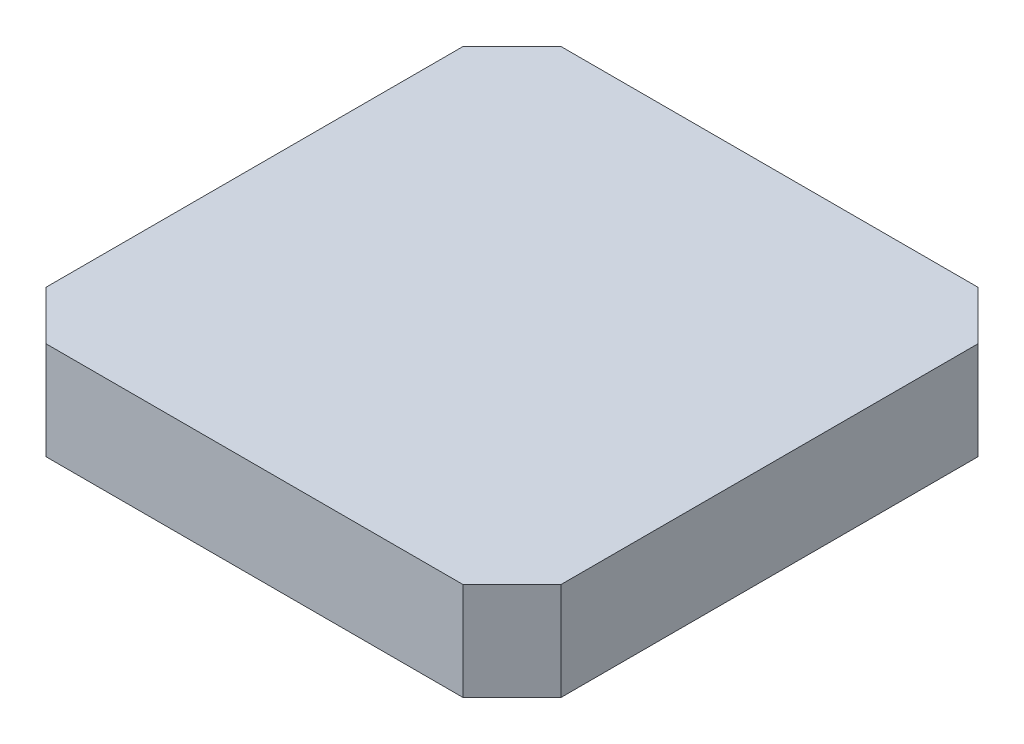
ISO-10303-21;
HEADER;
FILE_DESCRIPTION(('STEP AP214'),'2;1');
FILE_NAME('part.step','',(''),(''),'','','');
FILE_SCHEMA(('AUTOMOTIVE_DESIGN { 1 0 10303 214 1 1 1 1 }'));
ENDSEC;
DATA;
#1=APPLICATION_CONTEXT('core data for automotive mechanical design processes');
#2=APPLICATION_PROTOCOL_DEFINITION('international standard','automotive_design',2000,#1);
#3=PRODUCT_CONTEXT('',#1,'mechanical');
#4=PRODUCT('Part','Part','',(#3));
#5=PRODUCT_RELATED_PRODUCT_CATEGORY('part','',(#4));
#6=PRODUCT_DEFINITION_FORMATION('','',#4);
#7=PRODUCT_DEFINITION_CONTEXT('part definition',#1,'design');
#8=PRODUCT_DEFINITION('design','',#6,#7);
#9=PRODUCT_DEFINITION_SHAPE('','',#8);
#10=(LENGTH_UNIT() NAMED_UNIT(*) SI_UNIT(.MILLI.,.METRE.));
#11=(NAMED_UNIT(*) PLANE_ANGLE_UNIT() SI_UNIT($,.RADIAN.));
#12=(NAMED_UNIT(*) SI_UNIT($,.STERADIAN.) SOLID_ANGLE_UNIT());
#13=UNCERTAINTY_MEASURE_WITH_UNIT(LENGTH_MEASURE(1.E-05),#10,'distance_accuracy_value','');
#14=(GEOMETRIC_REPRESENTATION_CONTEXT(3) GLOBAL_UNCERTAINTY_ASSIGNED_CONTEXT((#13)) GLOBAL_UNIT_ASSIGNED_CONTEXT((#10,
#11,#12)) REPRESENTATION_CONTEXT('',''));
#15=CARTESIAN_POINT('',(0.,0.,0.));
#16=DIRECTION('',(0.,0.,1.));
#17=DIRECTION('',(1.,0.,0.));
#18=AXIS2_PLACEMENT_3D('',#15,#16,#17);
#19=CARTESIAN_POINT('',(21.05,8.,21.05));
#20=DIRECTION('',(-1.,0.,0.));
#21=DIRECTION('',(0.,0.,1.));
#22=AXIS2_PLACEMENT_3D('',#19,#20,#21);
#23=PLANE('',#22);
#24=DIRECTION('',(0.,0.,-1.));
#25=VECTOR('',#24,1.);
#26=CARTESIAN_POINT('',(21.05,0.,21.05));
#27=LINE('',#26,#25);
#28=CARTESIAN_POINT('',(21.05,0.,17.05));
#29=VERTEX_POINT('',#28);
#30=CARTESIAN_POINT('',(21.05,0.,-17.05));
#31=VERTEX_POINT('',#30);
#32=EDGE_CURVE('E127',#29,#31,#27,.T.);
#33=ORIENTED_EDGE('',*,*,#32,.T.);
#34=DIRECTION('',(0.,1.,0.));
#35=VECTOR('',#34,1.);
#36=CARTESIAN_POINT('',(21.05,8.,-17.05));
#37=LINE('',#36,#35);
#38=CARTESIAN_POINT('',(21.05,8.,-17.05));
#39=VERTEX_POINT('',#38);
#40=EDGE_CURVE('E104',#31,#39,#37,.T.);
#41=ORIENTED_EDGE('',*,*,#40,.T.);
#42=DIRECTION('',(0.,0.,-1.));
#43=VECTOR('',#42,1.);
#44=CARTESIAN_POINT('',(21.05,8.,21.05));
#45=LINE('',#44,#43);
#46=CARTESIAN_POINT('',(21.05,8.,17.05));
#47=VERTEX_POINT('',#46);
#48=EDGE_CURVE('E136',#47,#39,#45,.T.);
#49=ORIENTED_EDGE('',*,*,#48,.F.);
#50=DIRECTION('',(0.,-1.,0.));
#51=VECTOR('',#50,1.);
#52=CARTESIAN_POINT('',(21.05,8.,17.05));
#53=LINE('',#52,#51);
#54=EDGE_CURVE('E109',#47,#29,#53,.T.);
#55=ORIENTED_EDGE('',*,*,#54,.T.);
#56=EDGE_LOOP('',(#33,#41,#49,#55));
#57=FACE_BOUND('',#56,.T.);
#58=ADVANCED_FACE('F32',(#57),#23,.F.);
#59=CARTESIAN_POINT('',(-21.05,8.,-21.05));
#60=DIRECTION('',(0.,0.,1.));
#61=DIRECTION('',(1.,0.,0.));
#62=AXIS2_PLACEMENT_3D('',#59,#60,#61);
#63=PLANE('',#62);
#64=DIRECTION('',(-1.,0.,0.));
#65=VECTOR('',#64,1.);
#66=CARTESIAN_POINT('',(-21.05,8.,-21.05));
#67=LINE('',#66,#65);
#68=CARTESIAN_POINT('',(17.05,8.,-21.05));
#69=VERTEX_POINT('',#68);
#70=CARTESIAN_POINT('',(-17.05,8.,-21.05));
#71=VERTEX_POINT('',#70);
#72=EDGE_CURVE('E119',#69,#71,#67,.T.);
#73=ORIENTED_EDGE('',*,*,#72,.F.);
#74=DIRECTION('',(0.,-1.,0.));
#75=VECTOR('',#74,1.);
#76=CARTESIAN_POINT('',(17.05,8.,-21.05));
#77=LINE('',#76,#75);
#78=CARTESIAN_POINT('',(17.05,0.,-21.05));
#79=VERTEX_POINT('',#78);
#80=EDGE_CURVE('E103',#69,#79,#77,.T.);
#81=ORIENTED_EDGE('',*,*,#80,.T.);
#82=DIRECTION('',(-1.,0.,0.));
#83=VECTOR('',#82,1.);
#84=CARTESIAN_POINT('',(-21.05,0.,-21.05));
#85=LINE('',#84,#83);
#86=CARTESIAN_POINT('',(-17.05,0.,-21.05));
#87=VERTEX_POINT('',#86);
#88=EDGE_CURVE('E116',#79,#87,#85,.T.);
#89=ORIENTED_EDGE('',*,*,#88,.T.);
#90=DIRECTION('',(0.,1.,0.));
#91=VECTOR('',#90,1.);
#92=CARTESIAN_POINT('',(-17.05,8.,-21.05));
#93=LINE('',#92,#91);
#94=EDGE_CURVE('E121',#87,#71,#93,.T.);
#95=ORIENTED_EDGE('',*,*,#94,.T.);
#96=EDGE_LOOP('',(#73,#81,#89,#95));
#97=FACE_BOUND('',#96,.T.);
#98=ADVANCED_FACE('F115',(#97),#63,.F.);
#99=CARTESIAN_POINT('',(-21.05,8.,21.05));
#100=DIRECTION('',(1.,0.,0.));
#101=DIRECTION('',(0.,0.,-1.));
#102=AXIS2_PLACEMENT_3D('',#99,#100,#101);
#103=PLANE('',#102);
#104=DIRECTION('',(0.,0.,1.));
#105=VECTOR('',#104,1.);
#106=CARTESIAN_POINT('',(-21.05,8.,21.05));
#107=LINE('',#106,#105);
#108=CARTESIAN_POINT('',(-21.05,8.,-17.05));
#109=VERTEX_POINT('',#108);
#110=CARTESIAN_POINT('',(-21.05,8.,17.05));
#111=VERTEX_POINT('',#110);
#112=EDGE_CURVE('E159',#109,#111,#107,.T.);
#113=ORIENTED_EDGE('',*,*,#112,.F.);
#114=DIRECTION('',(0.,-1.,0.));
#115=VECTOR('',#114,1.);
#116=CARTESIAN_POINT('',(-21.05,8.,-17.05));
#117=LINE('',#116,#115);
#118=CARTESIAN_POINT('',(-21.05,0.,-17.05));
#119=VERTEX_POINT('',#118);
#120=EDGE_CURVE('E11',#109,#119,#117,.T.);
#121=ORIENTED_EDGE('',*,*,#120,.T.);
#122=DIRECTION('',(0.,0.,1.));
#123=VECTOR('',#122,1.);
#124=CARTESIAN_POINT('',(-21.05,0.,21.05));
#125=LINE('',#124,#123);
#126=CARTESIAN_POINT('',(-21.05,0.,17.05));
#127=VERTEX_POINT('',#126);
#128=EDGE_CURVE('E126',#119,#127,#125,.T.);
#129=ORIENTED_EDGE('',*,*,#128,.T.);
#130=DIRECTION('',(0.,1.,0.));
#131=VECTOR('',#130,1.);
#132=CARTESIAN_POINT('',(-21.05,8.,17.05));
#133=LINE('',#132,#131);
#134=EDGE_CURVE('E40',#127,#111,#133,.T.);
#135=ORIENTED_EDGE('',*,*,#134,.T.);
#136=EDGE_LOOP('',(#113,#121,#129,#135));
#137=FACE_BOUND('',#136,.T.);
#138=ADVANCED_FACE('F158',(#137),#103,.F.);
#139=CARTESIAN_POINT('',(-21.05,8.,21.05));
#140=DIRECTION('',(0.,0.,-1.));
#141=DIRECTION('',(-1.,0.,0.));
#142=AXIS2_PLACEMENT_3D('',#139,#140,#141);
#143=PLANE('',#142);
#144=DIRECTION('',(1.,0.,0.));
#145=VECTOR('',#144,1.);
#146=CARTESIAN_POINT('',(-21.05,0.,21.05));
#147=LINE('',#146,#145);
#148=CARTESIAN_POINT('',(-17.05,0.,21.05));
#149=VERTEX_POINT('',#148);
#150=CARTESIAN_POINT('',(17.05,0.,21.05));
#151=VERTEX_POINT('',#150);
#152=EDGE_CURVE('E130',#149,#151,#147,.T.);
#153=ORIENTED_EDGE('',*,*,#152,.T.);
#154=DIRECTION('',(0.,1.,0.));
#155=VECTOR('',#154,1.);
#156=CARTESIAN_POINT('',(17.05,8.,21.05));
#157=LINE('',#156,#155);
#158=CARTESIAN_POINT('',(17.05,8.,21.05));
#159=VERTEX_POINT('',#158);
#160=EDGE_CURVE('E47',#151,#159,#157,.T.);
#161=ORIENTED_EDGE('',*,*,#160,.T.);
#162=DIRECTION('',(1.,0.,0.));
#163=VECTOR('',#162,1.);
#164=CARTESIAN_POINT('',(-21.05,8.,21.05));
#165=LINE('',#164,#163);
#166=CARTESIAN_POINT('',(-17.05,8.,21.05));
#167=VERTEX_POINT('',#166);
#168=EDGE_CURVE('E137',#167,#159,#165,.T.);
#169=ORIENTED_EDGE('',*,*,#168,.F.);
#170=DIRECTION('',(0.,-1.,0.));
#171=VECTOR('',#170,1.);
#172=CARTESIAN_POINT('',(-17.05,8.,21.05));
#173=LINE('',#172,#171);
#174=EDGE_CURVE('E152',#167,#149,#173,.T.);
#175=ORIENTED_EDGE('',*,*,#174,.T.);
#176=EDGE_LOOP('',(#153,#161,#169,#175));
#177=FACE_BOUND('',#176,.T.);
#178=ADVANCED_FACE('F168',(#177),#143,.F.);
#179=CARTESIAN_POINT('',(0.,8.,0.));
#180=DIRECTION('',(0.,-1.,0.));
#181=DIRECTION('',(0.,0.,-1.));
#182=AXIS2_PLACEMENT_3D('',#179,#180,#181);
#183=PLANE('',#182);
#184=ORIENTED_EDGE('',*,*,#48,.T.);
#185=DIRECTION('',(0.707106781186546,0.,0.707106781186549));
#186=VECTOR('',#185,1.);
#187=CARTESIAN_POINT('',(17.05,8.,-21.05));
#188=LINE('',#187,#186);
#189=EDGE_CURVE('E150',#39,#69,#188,.F.);
#190=ORIENTED_EDGE('',*,*,#189,.T.);
#191=ORIENTED_EDGE('',*,*,#72,.T.);
#192=DIRECTION('',(0.707106781186549,0.,-0.707106781186546));
#193=VECTOR('',#192,1.);
#194=CARTESIAN_POINT('',(-21.05,8.,-17.05));
#195=LINE('',#194,#193);
#196=EDGE_CURVE('E146',#71,#109,#195,.F.);
#197=ORIENTED_EDGE('',*,*,#196,.T.);
#198=ORIENTED_EDGE('',*,*,#112,.T.);
#199=DIRECTION('',(-0.707106781186546,0.,-0.707106781186549));
#200=VECTOR('',#199,1.);
#201=CARTESIAN_POINT('',(-17.05,8.,21.05));
#202=LINE('',#201,#200);
#203=EDGE_CURVE('E54',#111,#167,#202,.F.);
#204=ORIENTED_EDGE('',*,*,#203,.T.);
#205=ORIENTED_EDGE('',*,*,#168,.T.);
#206=DIRECTION('',(-0.707106781186549,0.,0.707106781186546));
#207=VECTOR('',#206,1.);
#208=CARTESIAN_POINT('',(21.05,8.,17.05));
#209=LINE('',#208,#207);
#210=EDGE_CURVE('E148',#159,#47,#209,.F.);
#211=ORIENTED_EDGE('',*,*,#210,.T.);
#212=EDGE_LOOP('',(#184,#190,#191,#197,#198,#204,#205,#211));
#213=FACE_BOUND('',#212,.T.);
#214=ADVANCED_FACE('F163',(#213),#183,.F.);
#215=CARTESIAN_POINT('',(0.,0.,0.));
#216=DIRECTION('',(0.,-1.,0.));
#217=DIRECTION('',(0.,0.,-1.));
#218=AXIS2_PLACEMENT_3D('',#215,#216,#217);
#219=PLANE('',#218);
#220=ORIENTED_EDGE('',*,*,#88,.F.);
#221=DIRECTION('',(-0.707106781186546,0.,-0.707106781186549));
#222=VECTOR('',#221,1.);
#223=CARTESIAN_POINT('',(19.05,0.,-19.05));
#224=LINE('',#223,#222);
#225=EDGE_CURVE('E99',#79,#31,#224,.F.);
#226=ORIENTED_EDGE('',*,*,#225,.T.);
#227=ORIENTED_EDGE('',*,*,#32,.F.);
#228=DIRECTION('',(0.707106781186549,0.,-0.707106781186546));
#229=VECTOR('',#228,1.);
#230=CARTESIAN_POINT('',(19.05,0.,19.05));
#231=LINE('',#230,#229);
#232=EDGE_CURVE('E110',#29,#151,#231,.F.);
#233=ORIENTED_EDGE('',*,*,#232,.T.);
#234=ORIENTED_EDGE('',*,*,#152,.F.);
#235=DIRECTION('',(0.707106781186546,0.,0.707106781186549));
#236=VECTOR('',#235,1.);
#237=CARTESIAN_POINT('',(-19.05,0.,19.05));
#238=LINE('',#237,#236);
#239=EDGE_CURVE('E120',#149,#127,#238,.F.);
#240=ORIENTED_EDGE('',*,*,#239,.T.);
#241=ORIENTED_EDGE('',*,*,#128,.F.);
#242=DIRECTION('',(-0.707106781186549,0.,0.707106781186546));
#243=VECTOR('',#242,1.);
#244=CARTESIAN_POINT('',(-19.05,0.,-19.05));
#245=LINE('',#244,#243);
#246=EDGE_CURVE('E125',#119,#87,#245,.F.);
#247=ORIENTED_EDGE('',*,*,#246,.T.);
#248=EDGE_LOOP('',(#220,#226,#227,#233,#234,#240,#241,#247));
#249=FACE_BOUND('',#248,.T.);
#250=ADVANCED_FACE('F123',(#249),#219,.T.);
#251=CARTESIAN_POINT('',(17.05,8.,-21.05));
#252=DIRECTION('',(-0.707106781186549,0.,0.707106781186546));
#253=DIRECTION('',(0.,-1.,0.));
#254=AXIS2_PLACEMENT_3D('',#251,#252,#253);
#255=PLANE('',#254);
#256=ORIENTED_EDGE('',*,*,#189,.F.);
#257=ORIENTED_EDGE('',*,*,#40,.F.);
#258=ORIENTED_EDGE('',*,*,#225,.F.);
#259=ORIENTED_EDGE('',*,*,#80,.F.);
#260=EDGE_LOOP('',(#256,#257,#258,#259));
#261=FACE_BOUND('',#260,.T.);
#262=ADVANCED_FACE('F102',(#261),#255,.F.);
#263=CARTESIAN_POINT('',(21.05,8.,17.05));
#264=DIRECTION('',(-0.707106781186546,0.,-0.707106781186549));
#265=DIRECTION('',(0.,-1.,0.));
#266=AXIS2_PLACEMENT_3D('',#263,#264,#265);
#267=PLANE('',#266);
#268=ORIENTED_EDGE('',*,*,#210,.F.);
#269=ORIENTED_EDGE('',*,*,#160,.F.);
#270=ORIENTED_EDGE('',*,*,#232,.F.);
#271=ORIENTED_EDGE('',*,*,#54,.F.);
#272=EDGE_LOOP('',(#268,#269,#270,#271));
#273=FACE_BOUND('',#272,.T.);
#274=ADVANCED_FACE('F172',(#273),#267,.F.);
#275=CARTESIAN_POINT('',(-21.05,8.,-17.05));
#276=DIRECTION('',(0.707106781186546,0.,0.707106781186549));
#277=DIRECTION('',(0.,-1.,0.));
#278=AXIS2_PLACEMENT_3D('',#275,#276,#277);
#279=PLANE('',#278);
#280=ORIENTED_EDGE('',*,*,#196,.F.);
#281=ORIENTED_EDGE('',*,*,#94,.F.);
#282=ORIENTED_EDGE('',*,*,#246,.F.);
#283=ORIENTED_EDGE('',*,*,#120,.F.);
#284=EDGE_LOOP('',(#280,#281,#282,#283));
#285=FACE_BOUND('',#284,.T.);
#286=ADVANCED_FACE('F178',(#285),#279,.F.);
#287=CARTESIAN_POINT('',(-17.05,8.,21.05));
#288=DIRECTION('',(0.707106781186549,0.,-0.707106781186546));
#289=DIRECTION('',(0.,-1.,0.));
#290=AXIS2_PLACEMENT_3D('',#287,#288,#289);
#291=PLANE('',#290);
#292=ORIENTED_EDGE('',*,*,#203,.F.);
#293=ORIENTED_EDGE('',*,*,#134,.F.);
#294=ORIENTED_EDGE('',*,*,#239,.F.);
#295=ORIENTED_EDGE('',*,*,#174,.F.);
#296=EDGE_LOOP('',(#292,#293,#294,#295));
#297=FACE_BOUND('',#296,.T.);
#298=ADVANCED_FACE('F34',(#297),#291,.F.);
#299=CLOSED_SHELL('',(#58,#98,#138,#178,#214,#250,#262,#274,#286,#298));
#300=MANIFOLD_SOLID_BREP('B2',#299);
#301=ADVANCED_BREP_SHAPE_REPRESENTATION('',(#18,#300),#14);
#302=SHAPE_DEFINITION_REPRESENTATION(#9,#301);
ENDSEC;
END-ISO-10303-21;
